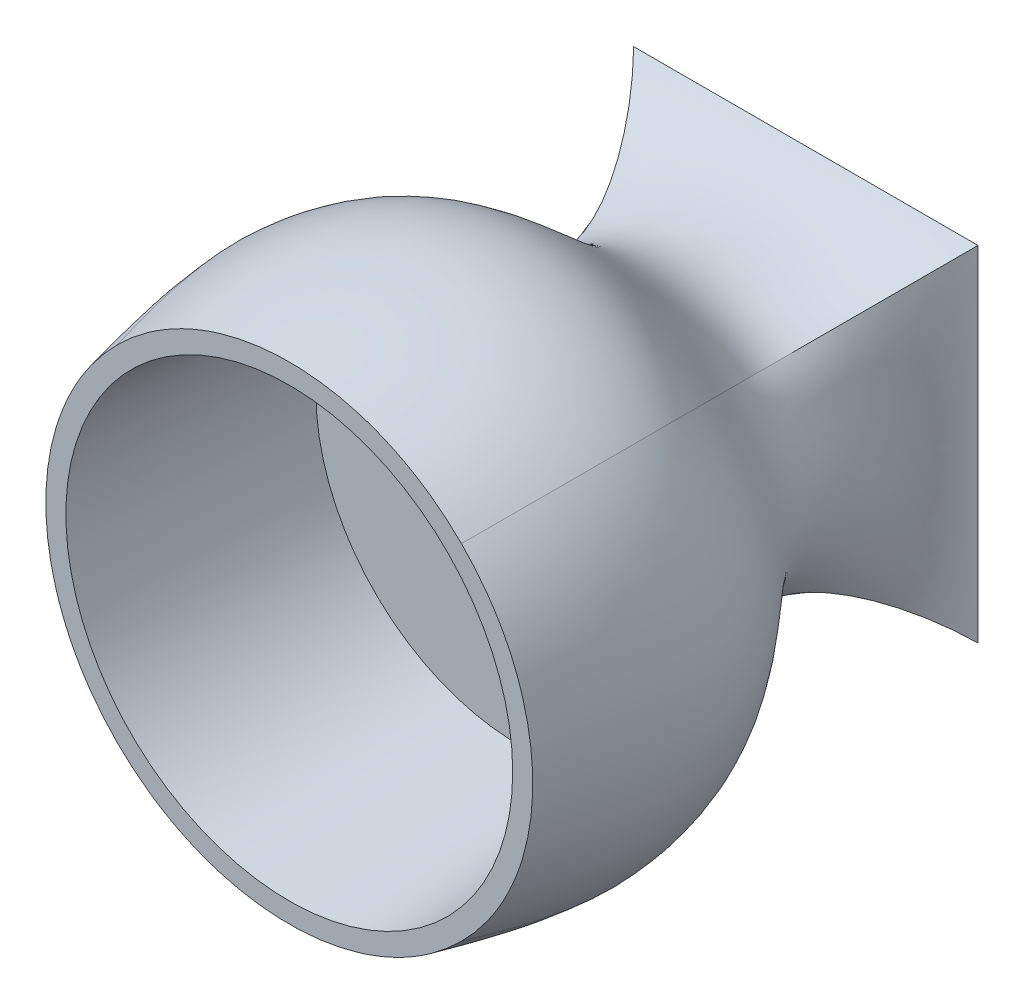
ISO-10303-21;
HEADER;
FILE_DESCRIPTION(('STEP AP214'),'2;1');
FILE_NAME('part.step','',(''),(''),'','','');
FILE_SCHEMA(('AUTOMOTIVE_DESIGN { 1 0 10303 214 1 1 1 1 }'));
ENDSEC;
DATA;
#1=APPLICATION_CONTEXT('core data for automotive mechanical design processes');
#2=APPLICATION_PROTOCOL_DEFINITION('international standard','automotive_design',2000,#1);
#3=PRODUCT_CONTEXT('',#1,'mechanical');
#4=PRODUCT('Part','Part','',(#3));
#5=PRODUCT_RELATED_PRODUCT_CATEGORY('part','',(#4));
#6=PRODUCT_DEFINITION_FORMATION('','',#4);
#7=PRODUCT_DEFINITION_CONTEXT('part definition',#1,'design');
#8=PRODUCT_DEFINITION('design','',#6,#7);
#9=PRODUCT_DEFINITION_SHAPE('','',#8);
#10=(LENGTH_UNIT() NAMED_UNIT(*) SI_UNIT(.MILLI.,.METRE.));
#11=(NAMED_UNIT(*) PLANE_ANGLE_UNIT() SI_UNIT($,.RADIAN.));
#12=(NAMED_UNIT(*) SI_UNIT($,.STERADIAN.) SOLID_ANGLE_UNIT());
#13=UNCERTAINTY_MEASURE_WITH_UNIT(LENGTH_MEASURE(1.E-05),#10,'distance_accuracy_value','');
#14=(GEOMETRIC_REPRESENTATION_CONTEXT(3) GLOBAL_UNCERTAINTY_ASSIGNED_CONTEXT((#13)) GLOBAL_UNIT_ASSIGNED_CONTEXT((#10,
#11,#12)) REPRESENTATION_CONTEXT('',''));
#15=CARTESIAN_POINT('',(0.,0.,0.));
#16=DIRECTION('',(0.,0.,1.));
#17=DIRECTION('',(1.,0.,0.));
#18=AXIS2_PLACEMENT_3D('',#15,#16,#17);
#19=CARTESIAN_POINT('',(0.,0.,90.));
#20=DIRECTION('',(0.,0.,1.));
#21=DIRECTION('',(1.,0.,0.));
#22=AXIS2_PLACEMENT_3D('',#19,#20,#21);
#23=PLANE('',#22);
#24=CARTESIAN_POINT('',(0.,0.,90.));
#25=DIRECTION('',(0.,0.,1.));
#26=DIRECTION('',(1.,0.,0.));
#27=AXIS2_PLACEMENT_3D('',#24,#25,#26);
#28=CIRCLE('',#27,38.9281135062187);
#29=CARTESIAN_POINT('',(38.9281135062187,0.,90.));
#30=VERTEX_POINT('',#29);
#31=EDGE_CURVE('E255',#30,#30,#28,.T.);
#32=ORIENTED_EDGE('',*,*,#31,.F.);
#33=EDGE_LOOP('',(#32));
#34=FACE_BOUND('',#33,.T.);
#35=CARTESIAN_POINT('',(0.,0.,90.));
#36=DIRECTION('',(0.,0.,1.));
#37=DIRECTION('',(1.,0.,0.));
#38=AXIS2_PLACEMENT_3D('',#35,#36,#37);
#39=CIRCLE('',#38,42.4264068711928);
#40=CARTESIAN_POINT('',(-30.,30.,90.));
#41=VERTEX_POINT('',#40);
#42=CARTESIAN_POINT('',(-30.,-30.,90.));
#43=VERTEX_POINT('',#42);
#44=EDGE_CURVE('E103',#41,#43,#39,.T.);
#45=ORIENTED_EDGE('',*,*,#44,.T.);
#46=CARTESIAN_POINT('',(30.,-30.,90.));
#47=VERTEX_POINT('',#46);
#48=EDGE_CURVE('E98',#43,#47,#39,.T.);
#49=ORIENTED_EDGE('',*,*,#48,.T.);
#50=CARTESIAN_POINT('',(30.,30.,90.));
#51=VERTEX_POINT('',#50);
#52=EDGE_CURVE('E343',#47,#51,#39,.T.);
#53=ORIENTED_EDGE('',*,*,#52,.T.);
#54=EDGE_CURVE('E236',#51,#41,#39,.T.);
#55=ORIENTED_EDGE('',*,*,#54,.T.);
#56=EDGE_LOOP('',(#45,#49,#53,#55));
#57=FACE_BOUND('',#56,.T.);
#58=ADVANCED_FACE('F63',(#34,#57),#23,.T.);
#59=CARTESIAN_POINT('',(-30.,-30.,0.));
#60=DIRECTION('',(0.,0.,-1.));
#61=DIRECTION('',(-1.,0.,0.));
#62=AXIS2_PLACEMENT_3D('',#59,#60,#61);
#63=PLANE('',#62);
#64=DIRECTION('',(0.,-1.,0.));
#65=VECTOR('',#64,1.);
#66=CARTESIAN_POINT('',(-30.,30.,0.));
#67=LINE('',#66,#65);
#68=CARTESIAN_POINT('',(-30.,30.,0.));
#69=VERTEX_POINT('',#68);
#70=CARTESIAN_POINT('',(-30.,-30.,0.));
#71=VERTEX_POINT('',#70);
#72=EDGE_CURVE('E116',#69,#71,#67,.T.);
#73=ORIENTED_EDGE('',*,*,#72,.F.);
#74=DIRECTION('',(-1.,0.,0.));
#75=VECTOR('',#74,1.);
#76=CARTESIAN_POINT('',(30.,30.,0.));
#77=LINE('',#76,#75);
#78=CARTESIAN_POINT('',(30.,30.,0.));
#79=VERTEX_POINT('',#78);
#80=EDGE_CURVE('E12',#79,#69,#77,.T.);
#81=ORIENTED_EDGE('',*,*,#80,.F.);
#82=DIRECTION('',(0.,1.,0.));
#83=VECTOR('',#82,1.);
#84=CARTESIAN_POINT('',(30.,30.,0.));
#85=LINE('',#84,#83);
#86=CARTESIAN_POINT('',(30.,-30.,0.));
#87=VERTEX_POINT('',#86);
#88=EDGE_CURVE('E74',#87,#79,#85,.T.);
#89=ORIENTED_EDGE('',*,*,#88,.F.);
#90=DIRECTION('',(1.,0.,0.));
#91=VECTOR('',#90,1.);
#92=CARTESIAN_POINT('',(30.,-30.,0.));
#93=LINE('',#92,#91);
#94=EDGE_CURVE('E113',#71,#87,#93,.T.);
#95=ORIENTED_EDGE('',*,*,#94,.F.);
#96=EDGE_LOOP('',(#73,#81,#89,#95));
#97=FACE_BOUND('',#96,.T.);
#98=ADVANCED_FACE('F115',(#97),#63,.T.);
#99=CARTESIAN_POINT('',(30.,30.,0.));
#100=CARTESIAN_POINT('',(24.5234086798505,24.5234086798505,5.55555555555556));
#101=CARTESIAN_POINT('',(10.0020018252459,10.0020018252459,28.4713034734147));
#102=CARTESIAN_POINT('',(37.4126053184714,37.4126053184714,48.7267112583439));
#103=CARTESIAN_POINT('',(31.5721069398383,31.5721069398383,80.5150489188835));
#104=CARTESIAN_POINT('',(30.,30.,90.));
#105=CARTESIAN_POINT('',(10.,30.,0.));
#106=CARTESIAN_POINT('',(8.17446955995018,24.5234086798505,5.55555555555556));
#107=CARTESIAN_POINT('',(5.88766998538979,22.2842511585411,28.4713034734147));
#108=CARTESIAN_POINT('',(16.2653307752268,55.6626313059885,48.7267112583439));
#109=CARTESIAN_POINT('',(13.9665853489198,48.1295572375313,80.5150489188835));
#110=CARTESIAN_POINT('',(13.442549702307,46.557450297693,90.));
#111=CARTESIAN_POINT('',(-10.,30.,0.));
#112=CARTESIAN_POINT('',(-8.17446955995018,24.5234086798505,5.55555555555556));
#113=CARTESIAN_POINT('',(-5.88766998538979,22.2842511585411,28.4713034734147));
#114=CARTESIAN_POINT('',(-16.2653307752268,55.6626313059885,48.7267112583439));
#115=CARTESIAN_POINT('',(-13.9665853489198,48.1295572375313,80.5150489188835));
#116=CARTESIAN_POINT('',(-13.442549702307,46.557450297693,90.));
#117=CARTESIAN_POINT('',(-30.,30.,0.));
#118=CARTESIAN_POINT('',(-24.5234086798505,24.5234086798505,5.55555555555556));
#119=CARTESIAN_POINT('',(-10.0020018252459,10.0020018252459,28.4713034734147));
#120=CARTESIAN_POINT('',(-37.4126053184714,37.4126053184714,48.7267112583439));
#121=CARTESIAN_POINT('',(-31.5721069398383,31.5721069398383,80.5150489188835));
#122=CARTESIAN_POINT('',(-30.,30.,90.));
#123=B_SPLINE_SURFACE_WITH_KNOTS('',3,3,((#99,#100,#101,#102,#103,#104),(#105,#106,#107,#108,
#109,#110),(#111,#112,#113,#114,#115,#116),(#117,#118,#119,#120,#121,#122)),.UNSPECIFIED.,.F.,
.F.,.F.,(4,4),(4,1,1,4),(0.,1.),(0.,0.284226887704337,0.593739185555325,1.),.UNSPECIFIED.);
#124=CARTESIAN_POINT('',(-30.,30.,0.));
#125=CARTESIAN_POINT('',(-24.5234086798505,24.5234086798505,5.55555555555556));
#126=CARTESIAN_POINT('',(-10.0020018252459,10.0020018252459,28.4713034734147));
#127=CARTESIAN_POINT('',(-37.4126053184714,37.4126053184714,48.7267112583439));
#128=CARTESIAN_POINT('',(-31.5721069398383,31.5721069398383,80.5150489188835));
#129=CARTESIAN_POINT('',(-30.,30.,90.));
#130=B_SPLINE_CURVE_WITH_KNOTS('',3,(#124,#125,#126,#127,#128,#129),.UNSPECIFIED.,.F.,.F.,(4,1,
1,4),(0.,0.284226887704337,0.593739185555325,1.),.UNSPECIFIED.);
#131=EDGE_CURVE('E83',#69,#41,#130,.T.);
#132=CARTESIAN_POINT('',(30.,30.,0.));
#133=CARTESIAN_POINT('',(24.5234086798505,24.5234086798505,5.55555555555556));
#134=CARTESIAN_POINT('',(10.0020018252459,10.0020018252459,28.4713034734147));
#135=CARTESIAN_POINT('',(37.4126053184714,37.4126053184714,48.7267112583439));
#136=CARTESIAN_POINT('',(31.5721069398383,31.5721069398383,80.5150489188835));
#137=CARTESIAN_POINT('',(30.,30.,90.));
#138=B_SPLINE_CURVE_WITH_KNOTS('',3,(#132,#133,#134,#135,#136,#137),.UNSPECIFIED.,.F.,.F.,(4,1,
1,4),(0.,0.284226887704337,0.593739185555325,1.),.UNSPECIFIED.);
#139=EDGE_CURVE('E135',#51,#79,#138,.F.);
#140=ORIENTED_EDGE('',*,*,#80,.T.);
#141=ORIENTED_EDGE('',*,*,#131,.T.);
#142=ORIENTED_EDGE('',*,*,#54,.F.);
#143=ORIENTED_EDGE('',*,*,#139,.T.);
#144=EDGE_LOOP('',(#140,#141,#142,#143));
#145=FACE_BOUND('',#144,.T.);
#146=ADVANCED_FACE('F201',(#145),#123,.T.);
#147=CARTESIAN_POINT('',(-30.,30.,0.));
#148=CARTESIAN_POINT('',(-24.5234086798505,24.5234086798505,5.55555555555556));
#149=CARTESIAN_POINT('',(-10.0020018252459,10.0020018252459,28.4713034734147));
#150=CARTESIAN_POINT('',(-37.4126053184713,37.4126053184714,48.7267112583439));
#151=CARTESIAN_POINT('',(-31.5721069398383,31.5721069398383,80.5150489188835));
#152=CARTESIAN_POINT('',(-30.,30.,90.));
#153=CARTESIAN_POINT('',(-30.,10.,0.));
#154=CARTESIAN_POINT('',(-24.5234086798505,8.17446955995018,5.55555555555556));
#155=CARTESIAN_POINT('',(-22.2842511585411,5.8876699853898,28.4713034734147));
#156=CARTESIAN_POINT('',(-55.6626313059885,16.2653307752268,48.7267112583439));
#157=CARTESIAN_POINT('',(-48.1295572375313,13.9665853489198,80.5150489188835));
#158=CARTESIAN_POINT('',(-46.557450297693,13.442549702307,90.));
#159=CARTESIAN_POINT('',(-30.,-10.,0.));
#160=CARTESIAN_POINT('',(-24.5234086798505,-8.17446955995017,5.55555555555556));
#161=CARTESIAN_POINT('',(-22.2842511585411,-5.88766998538979,28.4713034734147));
#162=CARTESIAN_POINT('',(-55.6626313059885,-16.2653307752268,48.7267112583439));
#163=CARTESIAN_POINT('',(-48.1295572375313,-13.9665853489198,80.5150489188835));
#164=CARTESIAN_POINT('',(-46.557450297693,-13.442549702307,90.));
#165=CARTESIAN_POINT('',(-30.,-30.,0.));
#166=CARTESIAN_POINT('',(-24.5234086798505,-24.5234086798505,5.55555555555556));
#167=CARTESIAN_POINT('',(-10.0020018252459,-10.0020018252459,28.4713034734147));
#168=CARTESIAN_POINT('',(-37.4126053184714,-37.4126053184714,48.7267112583439));
#169=CARTESIAN_POINT('',(-31.5721069398383,-31.5721069398383,80.5150489188835));
#170=CARTESIAN_POINT('',(-30.,-30.,90.));
#171=B_SPLINE_SURFACE_WITH_KNOTS('',3,3,((#147,#148,#149,#150,#151,#152),(#153,#154,#155,#156,
#157,#158),(#159,#160,#161,#162,#163,#164),(#165,#166,#167,#168,#169,#170)),.UNSPECIFIED.,.F.,
.F.,.F.,(4,4),(4,1,1,4),(0.,1.),(0.,0.284226887704337,0.593739185555325,1.),.UNSPECIFIED.);
#172=CARTESIAN_POINT('',(-30.,-30.,0.));
#173=CARTESIAN_POINT('',(-24.5234086798505,-24.5234086798505,5.55555555555556));
#174=CARTESIAN_POINT('',(-10.0020018252459,-10.0020018252459,28.4713034734147));
#175=CARTESIAN_POINT('',(-37.4126053184714,-37.4126053184714,48.7267112583439));
#176=CARTESIAN_POINT('',(-31.5721069398383,-31.5721069398383,80.5150489188835));
#177=CARTESIAN_POINT('',(-30.,-30.,90.));
#178=B_SPLINE_CURVE_WITH_KNOTS('',3,(#172,#173,#174,#175,#176,#177),.UNSPECIFIED.,.F.,.F.,(4,1,
1,4),(0.,0.284226887704337,0.593739185555325,1.),.UNSPECIFIED.);
#179=EDGE_CURVE('E129',#71,#43,#178,.T.);
#180=ORIENTED_EDGE('',*,*,#72,.T.);
#181=ORIENTED_EDGE('',*,*,#179,.T.);
#182=ORIENTED_EDGE('',*,*,#44,.F.);
#183=ORIENTED_EDGE('',*,*,#131,.F.);
#184=EDGE_LOOP('',(#180,#181,#182,#183));
#185=FACE_BOUND('',#184,.T.);
#186=ADVANCED_FACE('F128',(#185),#171,.T.);
#187=CARTESIAN_POINT('',(30.,-30.,0.));
#188=CARTESIAN_POINT('',(24.5234086798505,-24.5234086798505,5.55555555555556));
#189=CARTESIAN_POINT('',(10.0020018252459,-10.0020018252459,28.4713034734147));
#190=CARTESIAN_POINT('',(37.4126053184713,-37.4126053184714,48.7267112583439));
#191=CARTESIAN_POINT('',(31.5721069398383,-31.5721069398383,80.5150489188835));
#192=CARTESIAN_POINT('',(30.,-30.,90.));
#193=CARTESIAN_POINT('',(30.,-10.,0.));
#194=CARTESIAN_POINT('',(24.5234086798505,-8.17446955995018,5.55555555555556));
#195=CARTESIAN_POINT('',(22.2842511585411,-5.8876699853898,28.4713034734147));
#196=CARTESIAN_POINT('',(55.6626313059885,-16.2653307752268,48.7267112583439));
#197=CARTESIAN_POINT('',(48.1295572375313,-13.9665853489198,80.5150489188835));
#198=CARTESIAN_POINT('',(46.557450297693,-13.442549702307,90.));
#199=CARTESIAN_POINT('',(30.,10.,0.));
#200=CARTESIAN_POINT('',(24.5234086798505,8.17446955995017,5.55555555555556));
#201=CARTESIAN_POINT('',(22.2842511585411,5.88766998538978,28.4713034734147));
#202=CARTESIAN_POINT('',(55.6626313059885,16.2653307752268,48.7267112583439));
#203=CARTESIAN_POINT('',(48.1295572375313,13.9665853489197,80.5150489188835));
#204=CARTESIAN_POINT('',(46.557450297693,13.442549702307,90.));
#205=CARTESIAN_POINT('',(30.,30.,0.));
#206=CARTESIAN_POINT('',(24.5234086798505,24.5234086798505,5.55555555555556));
#207=CARTESIAN_POINT('',(10.0020018252459,10.0020018252459,28.4713034734147));
#208=CARTESIAN_POINT('',(37.4126053184714,37.4126053184713,48.7267112583439));
#209=CARTESIAN_POINT('',(31.5721069398383,31.5721069398383,80.5150489188835));
#210=CARTESIAN_POINT('',(30.,30.,90.));
#211=B_SPLINE_SURFACE_WITH_KNOTS('',3,3,((#187,#188,#189,#190,#191,#192),(#193,#194,#195,#196,
#197,#198),(#199,#200,#201,#202,#203,#204),(#205,#206,#207,#208,#209,#210)),.UNSPECIFIED.,.F.,
.F.,.F.,(4,4),(4,1,1,4),(0.,1.),(0.,0.284226887704337,0.593739185555325,1.),.UNSPECIFIED.);
#212=CARTESIAN_POINT('',(30.,-30.,0.));
#213=CARTESIAN_POINT('',(24.5234086798505,-24.5234086798505,5.55555555555556));
#214=CARTESIAN_POINT('',(10.0020018252459,-10.0020018252459,28.4713034734147));
#215=CARTESIAN_POINT('',(37.4126053184713,-37.4126053184714,48.7267112583439));
#216=CARTESIAN_POINT('',(31.5721069398383,-31.5721069398383,80.5150489188835));
#217=CARTESIAN_POINT('',(30.,-30.,90.));
#218=B_SPLINE_CURVE_WITH_KNOTS('',3,(#212,#213,#214,#215,#216,#217),.UNSPECIFIED.,.F.,.F.,(4,1,
1,4),(0.,0.284226887704337,0.593739185555325,1.),.UNSPECIFIED.);
#219=EDGE_CURVE('E136',#87,#47,#218,.T.);
#220=ORIENTED_EDGE('',*,*,#88,.T.);
#221=ORIENTED_EDGE('',*,*,#139,.F.);
#222=ORIENTED_EDGE('',*,*,#52,.F.);
#223=ORIENTED_EDGE('',*,*,#219,.F.);
#224=EDGE_LOOP('',(#220,#221,#222,#223));
#225=FACE_BOUND('',#224,.T.);
#226=ADVANCED_FACE('F166',(#225),#211,.T.);
#227=CARTESIAN_POINT('',(-30.,-30.,0.));
#228=CARTESIAN_POINT('',(-24.5234086798505,-24.5234086798505,5.55555555555556));
#229=CARTESIAN_POINT('',(-10.0020018252459,-10.0020018252459,28.4713034734147));
#230=CARTESIAN_POINT('',(-37.4126053184714,-37.4126053184713,48.7267112583439));
#231=CARTESIAN_POINT('',(-31.5721069398383,-31.5721069398383,80.5150489188835));
#232=CARTESIAN_POINT('',(-30.,-30.,90.));
#233=CARTESIAN_POINT('',(-10.,-30.,0.));
#234=CARTESIAN_POINT('',(-8.17446955995018,-24.5234086798505,5.55555555555556));
#235=CARTESIAN_POINT('',(-5.8876699853898,-22.2842511585411,28.4713034734147));
#236=CARTESIAN_POINT('',(-16.2653307752268,-55.6626313059884,48.7267112583439));
#237=CARTESIAN_POINT('',(-13.9665853489198,-48.1295572375313,80.5150489188835));
#238=CARTESIAN_POINT('',(-13.442549702307,-46.557450297693,90.));
#239=CARTESIAN_POINT('',(10.,-30.,0.));
#240=CARTESIAN_POINT('',(8.17446955995018,-24.5234086798505,5.55555555555556));
#241=CARTESIAN_POINT('',(5.88766998538979,-22.2842511585411,28.4713034734147));
#242=CARTESIAN_POINT('',(16.2653307752268,-55.6626313059885,48.7267112583439));
#243=CARTESIAN_POINT('',(13.9665853489197,-48.1295572375313,80.5150489188835));
#244=CARTESIAN_POINT('',(13.442549702307,-46.557450297693,90.));
#245=CARTESIAN_POINT('',(30.,-30.,0.));
#246=CARTESIAN_POINT('',(24.5234086798505,-24.5234086798505,5.55555555555556));
#247=CARTESIAN_POINT('',(10.0020018252459,-10.0020018252459,28.4713034734147));
#248=CARTESIAN_POINT('',(37.4126053184713,-37.4126053184714,48.7267112583439));
#249=CARTESIAN_POINT('',(31.5721069398383,-31.5721069398383,80.5150489188835));
#250=CARTESIAN_POINT('',(30.,-30.,90.));
#251=B_SPLINE_SURFACE_WITH_KNOTS('',3,3,((#227,#228,#229,#230,#231,#232),(#233,#234,#235,#236,
#237,#238),(#239,#240,#241,#242,#243,#244),(#245,#246,#247,#248,#249,#250)),.UNSPECIFIED.,.F.,
.F.,.F.,(4,4),(4,1,1,4),(0.,1.),(0.,0.284226887704337,0.593739185555325,1.),.UNSPECIFIED.);
#252=ORIENTED_EDGE('',*,*,#94,.T.);
#253=ORIENTED_EDGE('',*,*,#219,.T.);
#254=ORIENTED_EDGE('',*,*,#48,.F.);
#255=ORIENTED_EDGE('',*,*,#179,.F.);
#256=EDGE_LOOP('',(#252,#253,#254,#255));
#257=FACE_BOUND('',#256,.T.);
#258=ADVANCED_FACE('F133',(#257),#251,.T.);
#259=CARTESIAN_POINT('',(0.,0.,50.));
#260=DIRECTION('',(0.,0.,1.));
#261=DIRECTION('',(1.,0.,0.));
#262=AXIS2_PLACEMENT_3D('',#259,#260,#261);
#263=PLANE('',#262);
#264=CARTESIAN_POINT('',(0.,0.,50.));
#265=DIRECTION('',(0.,0.,1.));
#266=DIRECTION('',(1.,0.,0.));
#267=AXIS2_PLACEMENT_3D('',#264,#265,#266);
#268=CIRCLE('',#267,35.3556776924135);
#269=CARTESIAN_POINT('',(35.3556776924135,0.,50.));
#270=VERTEX_POINT('',#269);
#271=EDGE_CURVE('E258',#270,#270,#268,.T.);
#272=ORIENTED_EDGE('',*,*,#271,.T.);
#273=EDGE_LOOP('',(#272));
#274=FACE_BOUND('',#273,.T.);
#275=ADVANCED_FACE('F165',(#274),#263,.T.);
#276=CARTESIAN_POINT('',(0.,0.,50.));
#277=DIRECTION('',(0.,0.,1.));
#278=DIRECTION('',(1.,0.,0.));
#279=AXIS2_PLACEMENT_3D('',#276,#277,#278);
#280=CONICAL_SURFACE('',#279,35.3556776924135,0.0890745644839651);
#281=ORIENTED_EDGE('',*,*,#271,.F.);
#282=EDGE_LOOP('',(#281));
#283=FACE_BOUND('',#282,.T.);
#284=ORIENTED_EDGE('',*,*,#31,.T.);
#285=EDGE_LOOP('',(#284));
#286=FACE_BOUND('',#285,.T.);
#287=ADVANCED_FACE('F275',(#283,#286),#280,.F.);
#288=CLOSED_SHELL('',(#58,#98,#146,#186,#226,#258,#275,#287));
#289=MANIFOLD_SOLID_BREP('B2',#288);
#290=ADVANCED_BREP_SHAPE_REPRESENTATION('',(#18,#289),#14);
#291=SHAPE_DEFINITION_REPRESENTATION(#9,#290);
ENDSEC;
END-ISO-10303-21;
